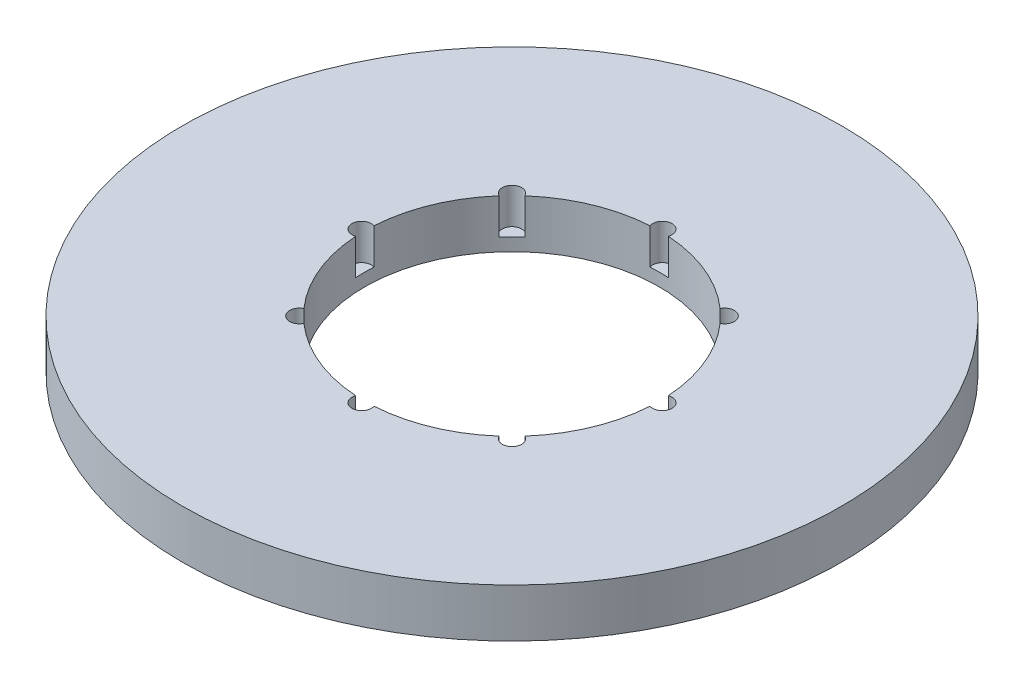
ISO-10303-21;
HEADER;
FILE_DESCRIPTION(('STEP AP214'),'2;1');
FILE_NAME('part.step','',(''),(''),'','','');
FILE_SCHEMA(('AUTOMOTIVE_DESIGN { 1 0 10303 214 1 1 1 1 }'));
ENDSEC;
DATA;
#1=APPLICATION_CONTEXT('core data for automotive mechanical design processes');
#2=APPLICATION_PROTOCOL_DEFINITION('international standard','automotive_design',2000,#1);
#3=PRODUCT_CONTEXT('',#1,'mechanical');
#4=PRODUCT('Part','Part','',(#3));
#5=PRODUCT_RELATED_PRODUCT_CATEGORY('part','',(#4));
#6=PRODUCT_DEFINITION_FORMATION('','',#4);
#7=PRODUCT_DEFINITION_CONTEXT('part definition',#1,'design');
#8=PRODUCT_DEFINITION('design','',#6,#7);
#9=PRODUCT_DEFINITION_SHAPE('','',#8);
#10=(LENGTH_UNIT() NAMED_UNIT(*) SI_UNIT(.MILLI.,.METRE.));
#11=(NAMED_UNIT(*) PLANE_ANGLE_UNIT() SI_UNIT($,.RADIAN.));
#12=(NAMED_UNIT(*) SI_UNIT($,.STERADIAN.) SOLID_ANGLE_UNIT());
#13=UNCERTAINTY_MEASURE_WITH_UNIT(LENGTH_MEASURE(1.E-05),#10,'distance_accuracy_value','');
#14=(GEOMETRIC_REPRESENTATION_CONTEXT(3) GLOBAL_UNCERTAINTY_ASSIGNED_CONTEXT((#13)) GLOBAL_UNIT_ASSIGNED_CONTEXT((#10,
#11,#12)) REPRESENTATION_CONTEXT('',''));
#15=CARTESIAN_POINT('',(0.,0.,0.));
#16=DIRECTION('',(0.,0.,1.));
#17=DIRECTION('',(1.,0.,0.));
#18=AXIS2_PLACEMENT_3D('',#15,#16,#17);
#19=CARTESIAN_POINT('',(0.,14.,0.));
#20=DIRECTION('',(0.,-1.,0.));
#21=DIRECTION('',(0.,0.,-1.));
#22=AXIS2_PLACEMENT_3D('',#19,#20,#21);
#23=CYLINDRICAL_SURFACE('',#22,95.);
#24=CARTESIAN_POINT('',(0.,14.,0.));
#25=DIRECTION('',(0.,1.,0.));
#26=DIRECTION('',(0.,0.,1.));
#27=AXIS2_PLACEMENT_3D('',#24,#25,#26);
#28=CIRCLE('',#27,95.);
#29=CARTESIAN_POINT('',(0.,14.,95.));
#30=VERTEX_POINT('',#29);
#31=EDGE_CURVE('E195',#30,#30,#28,.T.);
#32=ORIENTED_EDGE('',*,*,#31,.F.);
#33=EDGE_LOOP('',(#32));
#34=FACE_BOUND('',#33,.T.);
#35=CARTESIAN_POINT('',(0.,0.,0.));
#36=DIRECTION('',(0.,1.,0.));
#37=DIRECTION('',(0.,0.,1.));
#38=AXIS2_PLACEMENT_3D('',#35,#36,#37);
#39=CIRCLE('',#38,95.);
#40=CARTESIAN_POINT('',(0.,0.,95.));
#41=VERTEX_POINT('',#40);
#42=EDGE_CURVE('E179',#41,#41,#39,.T.);
#43=ORIENTED_EDGE('',*,*,#42,.T.);
#44=EDGE_LOOP('',(#43));
#45=FACE_BOUND('',#44,.T.);
#46=ADVANCED_FACE('F39',(#34,#45),#23,.T.);
#47=CARTESIAN_POINT('',(0.,14.,0.));
#48=DIRECTION('',(0.,1.,0.));
#49=DIRECTION('',(0.,0.,1.));
#50=AXIS2_PLACEMENT_3D('',#47,#48,#49);
#51=PLANE('',#50);
#52=CARTESIAN_POINT('',(1.51345955603055E-13,14.,43.3472045000824));
#53=DIRECTION('',(0.,1.,0.));
#54=DIRECTION('',(1.,0.,0.));
#55=AXIS2_PLACEMENT_3D('',#52,#53,#54);
#56=CIRCLE('',#55,2.78412642007656);
#57=CARTESIAN_POINT('',(-2.62479582339543,14.,42.4188689958312));
#58=VERTEX_POINT('',#57);
#59=CARTESIAN_POINT('',(2.62479582339572,14.,42.4188689958312));
#60=VERTEX_POINT('',#59);
#61=EDGE_CURVE('E176',#58,#60,#56,.T.);
#62=ORIENTED_EDGE('',*,*,#61,.F.);
#63=CARTESIAN_POINT('',(0.,14.,0.));
#64=DIRECTION('',(0.,1.,0.));
#65=DIRECTION('',(0.,0.,1.));
#66=AXIS2_PLACEMENT_3D('',#63,#64,#65);
#67=CIRCLE('',#66,42.5);
#68=CARTESIAN_POINT('',(-28.1386589912628,14.,31.8506808431692));
#69=VERTEX_POINT('',#68);
#70=EDGE_CURVE('E166',#69,#58,#67,.T.);
#71=ORIENTED_EDGE('',*,*,#70,.F.);
#72=CARTESIAN_POINT('',(-30.6511022474883,14.,30.6511022474884));
#73=DIRECTION('',(0.,1.,0.));
#74=DIRECTION('',(0.707106781186549,0.,0.707106781186546));
#75=AXIS2_PLACEMENT_3D('',#72,#73,#74);
#76=CIRCLE('',#75,2.78412642007656);
#77=CARTESIAN_POINT('',(-31.8506808431691,14.,28.1386589912629));
#78=VERTEX_POINT('',#77);
#79=EDGE_CURVE('E147',#78,#69,#76,.T.);
#80=ORIENTED_EDGE('',*,*,#79,.F.);
#81=CARTESIAN_POINT('',(-42.4188689958312,14.,2.62479582339557));
#82=VERTEX_POINT('',#81);
#83=EDGE_CURVE('E180',#82,#78,#67,.T.);
#84=ORIENTED_EDGE('',*,*,#83,.F.);
#85=CARTESIAN_POINT('',(-43.3472045000824,14.,0.));
#86=DIRECTION('',(0.,1.,0.));
#87=DIRECTION('',(0.,0.,1.));
#88=AXIS2_PLACEMENT_3D('',#85,#86,#87);
#89=CIRCLE('',#88,2.78412642007656);
#90=CARTESIAN_POINT('',(-42.4188689958312,14.,-2.62479582339557));
#91=VERTEX_POINT('',#90);
#92=EDGE_CURVE('E186',#91,#82,#89,.T.);
#93=ORIENTED_EDGE('',*,*,#92,.F.);
#94=CARTESIAN_POINT('',(-31.8506808431695,14.,-28.1386589912625));
#95=VERTEX_POINT('',#94);
#96=EDGE_CURVE('E182',#95,#91,#67,.T.);
#97=ORIENTED_EDGE('',*,*,#96,.F.);
#98=CARTESIAN_POINT('',(-30.6511022474887,14.,-30.6511022474879));
#99=DIRECTION('',(0.,1.,0.));
#100=DIRECTION('',(-0.707106781186539,0.,0.707106781186556));
#101=AXIS2_PLACEMENT_3D('',#98,#99,#100);
#102=CIRCLE('',#101,2.78412642007656);
#103=CARTESIAN_POINT('',(-28.1386589912633,14.,-31.8506808431688));
#104=VERTEX_POINT('',#103);
#105=EDGE_CURVE('E446',#104,#95,#102,.T.);
#106=ORIENTED_EDGE('',*,*,#105,.F.);
#107=CARTESIAN_POINT('',(-2.62479582339602,14.,-42.4188689958311));
#108=VERTEX_POINT('',#107);
#109=EDGE_CURVE('E452',#108,#104,#67,.T.);
#110=ORIENTED_EDGE('',*,*,#109,.F.);
#111=CARTESIAN_POINT('',(-4.54037866809165E-13,14.,-43.3472045000824));
#112=DIRECTION('',(0.,1.,0.));
#113=DIRECTION('',(-1.,0.,0.));
#114=AXIS2_PLACEMENT_3D('',#111,#112,#113);
#115=CIRCLE('',#114,2.78412642007656);
#116=CARTESIAN_POINT('',(2.62479582339513,14.,-42.4188689958312));
#117=VERTEX_POINT('',#116);
#118=EDGE_CURVE('E477',#117,#108,#115,.T.);
#119=ORIENTED_EDGE('',*,*,#118,.F.);
#120=CARTESIAN_POINT('',(28.1386589912626,14.,-31.8506808431694));
#121=VERTEX_POINT('',#120);
#122=EDGE_CURVE('E460',#121,#117,#67,.T.);
#123=ORIENTED_EDGE('',*,*,#122,.F.);
#124=CARTESIAN_POINT('',(30.651102247488,14.,-30.6511022474886));
#125=DIRECTION('',(0.,1.,0.));
#126=DIRECTION('',(-0.707106781186554,0.,-0.707106781186541));
#127=AXIS2_PLACEMENT_3D('',#124,#125,#126);
#128=CIRCLE('',#127,2.78412642007656);
#129=CARTESIAN_POINT('',(31.8506808431689,14.,-28.1386589912631));
#130=VERTEX_POINT('',#129);
#131=EDGE_CURVE('E464',#130,#121,#128,.T.);
#132=ORIENTED_EDGE('',*,*,#131,.F.);
#133=CARTESIAN_POINT('',(42.4188689958312,14.,-2.62479582339557));
#134=VERTEX_POINT('',#133);
#135=EDGE_CURVE('E459',#134,#130,#67,.T.);
#136=ORIENTED_EDGE('',*,*,#135,.F.);
#137=CARTESIAN_POINT('',(43.3472045000824,14.,0.));
#138=DIRECTION('',(0.,1.,0.));
#139=DIRECTION('',(0.,0.,-1.));
#140=AXIS2_PLACEMENT_3D('',#137,#138,#139);
#141=CIRCLE('',#140,2.78412642007656);
#142=CARTESIAN_POINT('',(42.4188689958312,14.,2.62479582339557));
#143=VERTEX_POINT('',#142);
#144=EDGE_CURVE('E469',#143,#134,#141,.T.);
#145=ORIENTED_EDGE('',*,*,#144,.F.);
#146=CARTESIAN_POINT('',(31.8506808431693,14.,28.1386589912627));
#147=VERTEX_POINT('',#146);
#148=EDGE_CURVE('E181',#147,#143,#67,.T.);
#149=ORIENTED_EDGE('',*,*,#148,.F.);
#150=CARTESIAN_POINT('',(30.6511022474885,14.,30.6511022474882));
#151=DIRECTION('',(0.,1.,0.));
#152=DIRECTION('',(0.707106781186544,0.,-0.707106781186551));
#153=AXIS2_PLACEMENT_3D('',#150,#151,#152);
#154=CIRCLE('',#153,2.78412642007656);
#155=CARTESIAN_POINT('',(28.138658991263,14.,31.850680843169));
#156=VERTEX_POINT('',#155);
#157=EDGE_CURVE('E475',#156,#147,#154,.T.);
#158=ORIENTED_EDGE('',*,*,#157,.F.);
#159=EDGE_CURVE('E177',#60,#156,#67,.T.);
#160=ORIENTED_EDGE('',*,*,#159,.F.);
#161=EDGE_LOOP('',(#62,#71,#80,#84,#93,#97,#106,#110,#119,#123,#132,#136,#145,#149,#158,#160));
#162=FACE_BOUND('',#161,.T.);
#163=ORIENTED_EDGE('',*,*,#31,.T.);
#164=EDGE_LOOP('',(#163));
#165=FACE_BOUND('',#164,.T.);
#166=ADVANCED_FACE('F172',(#162,#165),#51,.T.);
#167=CARTESIAN_POINT('',(0.,0.,0.));
#168=DIRECTION('',(0.,1.,0.));
#169=DIRECTION('',(0.,0.,1.));
#170=AXIS2_PLACEMENT_3D('',#167,#168,#169);
#171=PLANE('',#170);
#172=CARTESIAN_POINT('',(0.,0.,0.));
#173=DIRECTION('',(0.,1.,0.));
#174=DIRECTION('',(0.,0.,1.));
#175=AXIS2_PLACEMENT_3D('',#172,#173,#174);
#176=CIRCLE('',#175,42.5);
#177=CARTESIAN_POINT('',(0.,0.,42.5));
#178=VERTEX_POINT('',#177);
#179=EDGE_CURVE('E187',#178,#178,#176,.T.);
#180=ORIENTED_EDGE('',*,*,#179,.T.);
#181=EDGE_LOOP('',(#180));
#182=FACE_BOUND('',#181,.T.);
#183=ORIENTED_EDGE('',*,*,#42,.F.);
#184=EDGE_LOOP('',(#183));
#185=FACE_BOUND('',#184,.T.);
#186=ADVANCED_FACE('F270',(#182,#185),#171,.F.);
#187=CARTESIAN_POINT('',(0.,14.,0.));
#188=DIRECTION('',(0.,-1.,0.));
#189=DIRECTION('',(0.,0.,-1.));
#190=AXIS2_PLACEMENT_3D('',#187,#188,#189);
#191=CYLINDRICAL_SURFACE('',#190,42.5);
#192=DIRECTION('',(0.,1.,0.));
#193=VECTOR('',#192,1.);
#194=CARTESIAN_POINT('',(-2.62479582339543,8.83772118464505,42.4188689958312));
#195=LINE('',#194,#193);
#196=CARTESIAN_POINT('',(-2.62479582339543,3.67544236929009,42.4188689958312));
#197=VERTEX_POINT('',#196);
#198=EDGE_CURVE('E11',#197,#58,#195,.T.);
#199=ORIENTED_EDGE('',*,*,#198,.F.);
#200=CARTESIAN_POINT('',(0.,3.67544236929009,0.));
#201=DIRECTION('',(0.,1.,0.));
#202=DIRECTION('',(0.,0.,1.));
#203=AXIS2_PLACEMENT_3D('',#200,#201,#202);
#204=CIRCLE('',#203,42.5);
#205=CARTESIAN_POINT('',(2.62479582339572,3.67544236929009,42.4188689958312));
#206=VERTEX_POINT('',#205);
#207=EDGE_CURVE('E250',#197,#206,#204,.T.);
#208=ORIENTED_EDGE('',*,*,#207,.T.);
#209=DIRECTION('',(0.,1.,0.));
#210=VECTOR('',#209,1.);
#211=CARTESIAN_POINT('',(2.62479582339572,8.83772118464505,42.4188689958312));
#212=LINE('',#211,#210);
#213=EDGE_CURVE('E46',#60,#206,#212,.F.);
#214=ORIENTED_EDGE('',*,*,#213,.F.);
#215=ORIENTED_EDGE('',*,*,#159,.T.);
#216=DIRECTION('',(0.,1.,0.));
#217=VECTOR('',#216,1.);
#218=CARTESIAN_POINT('',(28.138658991263,8.83772118464505,31.850680843169));
#219=LINE('',#218,#217);
#220=CARTESIAN_POINT('',(28.138658991263,3.67544236929009,31.850680843169));
#221=VERTEX_POINT('',#220);
#222=EDGE_CURVE('E244',#221,#156,#219,.T.);
#223=ORIENTED_EDGE('',*,*,#222,.F.);
#224=CARTESIAN_POINT('',(0.,3.67544236929009,0.));
#225=DIRECTION('',(0.,1.,0.));
#226=DIRECTION('',(0.,0.,1.));
#227=AXIS2_PLACEMENT_3D('',#224,#225,#226);
#228=CIRCLE('',#227,42.5);
#229=CARTESIAN_POINT('',(31.8506808431693,3.67544236929009,28.1386589912627));
#230=VERTEX_POINT('',#229);
#231=EDGE_CURVE('E238',#221,#230,#228,.T.);
#232=ORIENTED_EDGE('',*,*,#231,.T.);
#233=DIRECTION('',(0.,1.,0.));
#234=VECTOR('',#233,1.);
#235=CARTESIAN_POINT('',(31.8506808431693,8.83772118464505,28.1386589912627));
#236=LINE('',#235,#234);
#237=EDGE_CURVE('E242',#147,#230,#236,.F.);
#238=ORIENTED_EDGE('',*,*,#237,.F.);
#239=ORIENTED_EDGE('',*,*,#148,.T.);
#240=DIRECTION('',(0.,1.,0.));
#241=VECTOR('',#240,1.);
#242=CARTESIAN_POINT('',(42.4188689958312,8.83772118464505,2.62479582339557));
#243=LINE('',#242,#241);
#244=CARTESIAN_POINT('',(42.4188689958312,3.67544236929009,2.62479582339557));
#245=VERTEX_POINT('',#244);
#246=EDGE_CURVE('E236',#245,#143,#243,.T.);
#247=ORIENTED_EDGE('',*,*,#246,.F.);
#248=CARTESIAN_POINT('',(0.,3.67544236929009,0.));
#249=DIRECTION('',(0.,1.,0.));
#250=DIRECTION('',(0.,0.,1.));
#251=AXIS2_PLACEMENT_3D('',#248,#249,#250);
#252=CIRCLE('',#251,42.5);
#253=CARTESIAN_POINT('',(42.4188689958312,3.67544236929009,-2.62479582339557));
#254=VERTEX_POINT('',#253);
#255=EDGE_CURVE('E235',#245,#254,#252,.T.);
#256=ORIENTED_EDGE('',*,*,#255,.T.);
#257=DIRECTION('',(0.,1.,0.));
#258=VECTOR('',#257,1.);
#259=CARTESIAN_POINT('',(42.4188689958312,8.83772118464505,-2.62479582339557));
#260=LINE('',#259,#258);
#261=EDGE_CURVE('E234',#134,#254,#260,.F.);
#262=ORIENTED_EDGE('',*,*,#261,.F.);
#263=ORIENTED_EDGE('',*,*,#135,.T.);
#264=DIRECTION('',(0.,1.,0.));
#265=VECTOR('',#264,1.);
#266=CARTESIAN_POINT('',(31.8506808431689,8.83772118464505,-28.1386589912631));
#267=LINE('',#266,#265);
#268=CARTESIAN_POINT('',(31.8506808431689,3.67544236929009,-28.1386589912631));
#269=VERTEX_POINT('',#268);
#270=EDGE_CURVE('E229',#269,#130,#267,.T.);
#271=ORIENTED_EDGE('',*,*,#270,.F.);
#272=CARTESIAN_POINT('',(0.,3.67544236929009,0.));
#273=DIRECTION('',(0.,1.,0.));
#274=DIRECTION('',(0.,0.,1.));
#275=AXIS2_PLACEMENT_3D('',#272,#273,#274);
#276=CIRCLE('',#275,42.5);
#277=CARTESIAN_POINT('',(28.1386589912626,3.67544236929009,-31.8506808431694));
#278=VERTEX_POINT('',#277);
#279=EDGE_CURVE('E221',#269,#278,#276,.T.);
#280=ORIENTED_EDGE('',*,*,#279,.T.);
#281=DIRECTION('',(0.,1.,0.));
#282=VECTOR('',#281,1.);
#283=CARTESIAN_POINT('',(28.1386589912626,8.83772118464505,-31.8506808431694));
#284=LINE('',#283,#282);
#285=EDGE_CURVE('E230',#121,#278,#284,.F.);
#286=ORIENTED_EDGE('',*,*,#285,.F.);
#287=ORIENTED_EDGE('',*,*,#122,.T.);
#288=DIRECTION('',(0.,1.,0.));
#289=VECTOR('',#288,1.);
#290=CARTESIAN_POINT('',(2.62479582339513,8.83772118464505,-42.4188689958312));
#291=LINE('',#290,#289);
#292=CARTESIAN_POINT('',(2.62479582339513,3.67544236929009,-42.4188689958312));
#293=VERTEX_POINT('',#292);
#294=EDGE_CURVE('E225',#293,#117,#291,.T.);
#295=ORIENTED_EDGE('',*,*,#294,.F.);
#296=CARTESIAN_POINT('',(0.,3.67544236929009,0.));
#297=DIRECTION('',(0.,1.,0.));
#298=DIRECTION('',(0.,0.,1.));
#299=AXIS2_PLACEMENT_3D('',#296,#297,#298);
#300=CIRCLE('',#299,42.5);
#301=CARTESIAN_POINT('',(-2.62479582339602,3.67544236929009,-42.4188689958311));
#302=VERTEX_POINT('',#301);
#303=EDGE_CURVE('E216',#293,#302,#300,.T.);
#304=ORIENTED_EDGE('',*,*,#303,.T.);
#305=DIRECTION('',(0.,1.,0.));
#306=VECTOR('',#305,1.);
#307=CARTESIAN_POINT('',(-2.62479582339602,8.83772118464505,-42.4188689958311));
#308=LINE('',#307,#306);
#309=EDGE_CURVE('E218',#108,#302,#308,.F.);
#310=ORIENTED_EDGE('',*,*,#309,.F.);
#311=ORIENTED_EDGE('',*,*,#109,.T.);
#312=DIRECTION('',(0.,1.,0.));
#313=VECTOR('',#312,1.);
#314=CARTESIAN_POINT('',(-28.1386589912633,8.83772118464505,-31.8506808431688));
#315=LINE('',#314,#313);
#316=CARTESIAN_POINT('',(-28.1386589912633,3.67544236929009,-31.8506808431688));
#317=VERTEX_POINT('',#316);
#318=EDGE_CURVE('E212',#317,#104,#315,.T.);
#319=ORIENTED_EDGE('',*,*,#318,.F.);
#320=CARTESIAN_POINT('',(0.,3.67544236929009,0.));
#321=DIRECTION('',(0.,1.,0.));
#322=DIRECTION('',(0.,0.,1.));
#323=AXIS2_PLACEMENT_3D('',#320,#321,#322);
#324=CIRCLE('',#323,42.5);
#325=CARTESIAN_POINT('',(-31.8506808431695,3.67544236929009,-28.1386589912625));
#326=VERTEX_POINT('',#325);
#327=EDGE_CURVE('E208',#317,#326,#324,.T.);
#328=ORIENTED_EDGE('',*,*,#327,.T.);
#329=DIRECTION('',(0.,1.,0.));
#330=VECTOR('',#329,1.);
#331=CARTESIAN_POINT('',(-31.8506808431695,8.83772118464505,-28.1386589912625));
#332=LINE('',#331,#330);
#333=EDGE_CURVE('E211',#95,#326,#332,.F.);
#334=ORIENTED_EDGE('',*,*,#333,.F.);
#335=ORIENTED_EDGE('',*,*,#96,.T.);
#336=DIRECTION('',(0.,1.,0.));
#337=VECTOR('',#336,1.);
#338=CARTESIAN_POINT('',(-42.4188689958312,8.83772118464505,-2.62479582339557));
#339=LINE('',#338,#337);
#340=CARTESIAN_POINT('',(-42.4188689958312,3.67544236929009,-2.62479582339557));
#341=VERTEX_POINT('',#340);
#342=EDGE_CURVE('E201',#341,#91,#339,.T.);
#343=ORIENTED_EDGE('',*,*,#342,.F.);
#344=CARTESIAN_POINT('',(0.,3.67544236929009,0.));
#345=DIRECTION('',(0.,1.,0.));
#346=DIRECTION('',(0.,0.,1.));
#347=AXIS2_PLACEMENT_3D('',#344,#345,#346);
#348=CIRCLE('',#347,42.5);
#349=CARTESIAN_POINT('',(-42.4188689958312,3.67544236929009,2.62479582339557));
#350=VERTEX_POINT('',#349);
#351=EDGE_CURVE('E194',#341,#350,#348,.T.);
#352=ORIENTED_EDGE('',*,*,#351,.T.);
#353=DIRECTION('',(0.,1.,0.));
#354=VECTOR('',#353,1.);
#355=CARTESIAN_POINT('',(-42.4188689958312,8.83772118464505,2.62479582339557));
#356=LINE('',#355,#354);
#357=EDGE_CURVE('E199',#82,#350,#356,.F.);
#358=ORIENTED_EDGE('',*,*,#357,.F.);
#359=ORIENTED_EDGE('',*,*,#83,.T.);
#360=DIRECTION('',(0.,1.,0.));
#361=VECTOR('',#360,1.);
#362=CARTESIAN_POINT('',(-31.8506808431691,8.83772118464505,28.1386589912629));
#363=LINE('',#362,#361);
#364=CARTESIAN_POINT('',(-31.8506808431691,3.67544236929009,28.1386589912629));
#365=VERTEX_POINT('',#364);
#366=EDGE_CURVE('E160',#365,#78,#363,.T.);
#367=ORIENTED_EDGE('',*,*,#366,.F.);
#368=CARTESIAN_POINT('',(0.,3.67544236929009,0.));
#369=DIRECTION('',(0.,1.,0.));
#370=DIRECTION('',(0.,0.,1.));
#371=AXIS2_PLACEMENT_3D('',#368,#369,#370);
#372=CIRCLE('',#371,42.5);
#373=CARTESIAN_POINT('',(-28.1386589912628,3.67544236929009,31.8506808431692));
#374=VERTEX_POINT('',#373);
#375=EDGE_CURVE('E168',#365,#374,#372,.T.);
#376=ORIENTED_EDGE('',*,*,#375,.T.);
#377=DIRECTION('',(0.,1.,0.));
#378=VECTOR('',#377,1.);
#379=CARTESIAN_POINT('',(-28.1386589912628,8.83772118464505,31.8506808431692));
#380=LINE('',#379,#378);
#381=EDGE_CURVE('E152',#69,#374,#380,.F.);
#382=ORIENTED_EDGE('',*,*,#381,.F.);
#383=ORIENTED_EDGE('',*,*,#70,.T.);
#384=EDGE_LOOP('',(#199,#208,#214,#215,#223,#232,#238,#239,#247,#256,#262,#263,#271,#280,#286,
#287,#295,#304,#310,#311,#319,#328,#334,#335,#343,#352,#358,#359,#367,#376,#382,#383));
#385=FACE_BOUND('',#384,.T.);
#386=ORIENTED_EDGE('',*,*,#179,.F.);
#387=EDGE_LOOP('',(#386));
#388=FACE_BOUND('',#387,.T.);
#389=ADVANCED_FACE('F170',(#385,#388),#191,.F.);
#390=CARTESIAN_POINT('',(-43.3472045000824,3.67544236929009,0.));
#391=DIRECTION('',(0.,1.,0.));
#392=DIRECTION('',(0.,0.,1.));
#393=AXIS2_PLACEMENT_3D('',#390,#391,#392);
#394=CYLINDRICAL_SURFACE('',#393,2.78412642007656);
#395=ORIENTED_EDGE('',*,*,#342,.T.);
#396=ORIENTED_EDGE('',*,*,#92,.T.);
#397=ORIENTED_EDGE('',*,*,#357,.T.);
#398=CARTESIAN_POINT('',(-43.3472045000824,3.67544236929009,0.));
#399=DIRECTION('',(0.,1.,0.));
#400=DIRECTION('',(0.,0.,1.));
#401=AXIS2_PLACEMENT_3D('',#398,#399,#400);
#402=CIRCLE('',#401,2.78412642007656);
#403=EDGE_CURVE('E191',#341,#350,#402,.T.);
#404=ORIENTED_EDGE('',*,*,#403,.F.);
#405=EDGE_LOOP('',(#395,#396,#397,#404));
#406=FACE_BOUND('',#405,.T.);
#407=ADVANCED_FACE('F279',(#406),#394,.F.);
#408=CARTESIAN_POINT('',(-43.3472045000824,3.67544236929009,0.));
#409=DIRECTION('',(0.,1.,0.));
#410=DIRECTION('',(0.,0.,1.));
#411=AXIS2_PLACEMENT_3D('',#408,#409,#410);
#412=PLANE('',#411);
#413=ORIENTED_EDGE('',*,*,#403,.T.);
#414=ORIENTED_EDGE('',*,*,#351,.F.);
#415=EDGE_LOOP('',(#413,#414));
#416=FACE_BOUND('',#415,.T.);
#417=ADVANCED_FACE('F285',(#416),#412,.T.);
#418=CARTESIAN_POINT('',(-30.6511022474883,3.67544236929009,30.6511022474884));
#419=DIRECTION('',(0.,1.,0.));
#420=DIRECTION('',(0.,0.,1.));
#421=AXIS2_PLACEMENT_3D('',#418,#419,#420);
#422=CYLINDRICAL_SURFACE('',#421,2.78412642007656);
#423=ORIENTED_EDGE('',*,*,#366,.T.);
#424=ORIENTED_EDGE('',*,*,#79,.T.);
#425=ORIENTED_EDGE('',*,*,#381,.T.);
#426=CARTESIAN_POINT('',(-30.6511022474883,3.67544236929009,30.6511022474884));
#427=DIRECTION('',(0.,1.,0.));
#428=DIRECTION('',(0.707106781186549,0.,0.707106781186546));
#429=AXIS2_PLACEMENT_3D('',#426,#427,#428);
#430=CIRCLE('',#429,2.78412642007656);
#431=EDGE_CURVE('E165',#365,#374,#430,.T.);
#432=ORIENTED_EDGE('',*,*,#431,.F.);
#433=EDGE_LOOP('',(#423,#424,#425,#432));
#434=FACE_BOUND('',#433,.T.);
#435=ADVANCED_FACE('F155',(#434),#422,.F.);
#436=CARTESIAN_POINT('',(-30.6511022474883,3.67544236929009,30.6511022474884));
#437=DIRECTION('',(0.,1.,0.));
#438=DIRECTION('',(0.707106781186549,0.,0.707106781186546));
#439=AXIS2_PLACEMENT_3D('',#436,#437,#438);
#440=PLANE('',#439);
#441=ORIENTED_EDGE('',*,*,#431,.T.);
#442=ORIENTED_EDGE('',*,*,#375,.F.);
#443=EDGE_LOOP('',(#441,#442));
#444=FACE_BOUND('',#443,.T.);
#445=ADVANCED_FACE('F288',(#444),#440,.T.);
#446=CARTESIAN_POINT('',(-30.6511022474887,3.67544236929009,-30.6511022474879));
#447=DIRECTION('',(0.,1.,0.));
#448=DIRECTION('',(0.,0.,1.));
#449=AXIS2_PLACEMENT_3D('',#446,#447,#448);
#450=CYLINDRICAL_SURFACE('',#449,2.78412642007656);
#451=ORIENTED_EDGE('',*,*,#318,.T.);
#452=ORIENTED_EDGE('',*,*,#105,.T.);
#453=ORIENTED_EDGE('',*,*,#333,.T.);
#454=CARTESIAN_POINT('',(-30.6511022474887,3.67544236929009,-30.6511022474879));
#455=DIRECTION('',(0.,1.,0.));
#456=DIRECTION('',(-0.707106781186539,0.,0.707106781186556));
#457=AXIS2_PLACEMENT_3D('',#454,#455,#456);
#458=CIRCLE('',#457,2.78412642007656);
#459=EDGE_CURVE('E447',#317,#326,#458,.T.);
#460=ORIENTED_EDGE('',*,*,#459,.F.);
#461=EDGE_LOOP('',(#451,#452,#453,#460));
#462=FACE_BOUND('',#461,.T.);
#463=ADVANCED_FACE('F295',(#462),#450,.F.);
#464=CARTESIAN_POINT('',(-30.6511022474887,3.67544236929009,-30.6511022474879));
#465=DIRECTION('',(0.,1.,0.));
#466=DIRECTION('',(-0.707106781186539,0.,0.707106781186556));
#467=AXIS2_PLACEMENT_3D('',#464,#465,#466);
#468=PLANE('',#467);
#469=ORIENTED_EDGE('',*,*,#459,.T.);
#470=ORIENTED_EDGE('',*,*,#327,.F.);
#471=EDGE_LOOP('',(#469,#470));
#472=FACE_BOUND('',#471,.T.);
#473=ADVANCED_FACE('F375',(#472),#468,.T.);
#474=CARTESIAN_POINT('',(-4.54037866809165E-13,3.67544236929009,-43.3472045000824));
#475=DIRECTION('',(0.,1.,0.));
#476=DIRECTION('',(0.,0.,1.));
#477=AXIS2_PLACEMENT_3D('',#474,#475,#476);
#478=CYLINDRICAL_SURFACE('',#477,2.78412642007656);
#479=ORIENTED_EDGE('',*,*,#294,.T.);
#480=ORIENTED_EDGE('',*,*,#118,.T.);
#481=ORIENTED_EDGE('',*,*,#309,.T.);
#482=CARTESIAN_POINT('',(-4.54037866809165E-13,3.67544236929009,-43.3472045000824));
#483=DIRECTION('',(0.,1.,0.));
#484=DIRECTION('',(-1.,0.,0.));
#485=AXIS2_PLACEMENT_3D('',#482,#483,#484);
#486=CIRCLE('',#485,2.78412642007656);
#487=EDGE_CURVE('E467',#293,#302,#486,.T.);
#488=ORIENTED_EDGE('',*,*,#487,.F.);
#489=EDGE_LOOP('',(#479,#480,#481,#488));
#490=FACE_BOUND('',#489,.T.);
#491=ADVANCED_FACE('F361',(#490),#478,.F.);
#492=CARTESIAN_POINT('',(-4.54037866809165E-13,3.67544236929009,-43.3472045000824));
#493=DIRECTION('',(0.,1.,0.));
#494=DIRECTION('',(-1.,0.,0.));
#495=AXIS2_PLACEMENT_3D('',#492,#493,#494);
#496=PLANE('',#495);
#497=ORIENTED_EDGE('',*,*,#487,.T.);
#498=ORIENTED_EDGE('',*,*,#303,.F.);
#499=EDGE_LOOP('',(#497,#498));
#500=FACE_BOUND('',#499,.T.);
#501=ADVANCED_FACE('F297',(#500),#496,.T.);
#502=CARTESIAN_POINT('',(30.651102247488,3.67544236929009,-30.6511022474886));
#503=DIRECTION('',(0.,1.,0.));
#504=DIRECTION('',(0.,0.,1.));
#505=AXIS2_PLACEMENT_3D('',#502,#503,#504);
#506=CYLINDRICAL_SURFACE('',#505,2.78412642007656);
#507=ORIENTED_EDGE('',*,*,#270,.T.);
#508=ORIENTED_EDGE('',*,*,#131,.T.);
#509=ORIENTED_EDGE('',*,*,#285,.T.);
#510=CARTESIAN_POINT('',(30.651102247488,3.67544236929009,-30.6511022474886));
#511=DIRECTION('',(0.,1.,0.));
#512=DIRECTION('',(-0.707106781186554,0.,-0.707106781186541));
#513=AXIS2_PLACEMENT_3D('',#510,#511,#512);
#514=CIRCLE('',#513,2.78412642007656);
#515=EDGE_CURVE('E470',#269,#278,#514,.T.);
#516=ORIENTED_EDGE('',*,*,#515,.F.);
#517=EDGE_LOOP('',(#507,#508,#509,#516));
#518=FACE_BOUND('',#517,.T.);
#519=ADVANCED_FACE('F294',(#518),#506,.F.);
#520=CARTESIAN_POINT('',(30.651102247488,3.67544236929009,-30.6511022474886));
#521=DIRECTION('',(0.,1.,0.));
#522=DIRECTION('',(-0.707106781186554,0.,-0.707106781186541));
#523=AXIS2_PLACEMENT_3D('',#520,#521,#522);
#524=PLANE('',#523);
#525=ORIENTED_EDGE('',*,*,#515,.T.);
#526=ORIENTED_EDGE('',*,*,#279,.F.);
#527=EDGE_LOOP('',(#525,#526));
#528=FACE_BOUND('',#527,.T.);
#529=ADVANCED_FACE('F300',(#528),#524,.T.);
#530=CARTESIAN_POINT('',(43.3472045000824,3.67544236929009,0.));
#531=DIRECTION('',(0.,1.,0.));
#532=DIRECTION('',(0.,0.,1.));
#533=AXIS2_PLACEMENT_3D('',#530,#531,#532);
#534=CYLINDRICAL_SURFACE('',#533,2.78412642007656);
#535=ORIENTED_EDGE('',*,*,#246,.T.);
#536=ORIENTED_EDGE('',*,*,#144,.T.);
#537=ORIENTED_EDGE('',*,*,#261,.T.);
#538=CARTESIAN_POINT('',(43.3472045000824,3.67544236929009,0.));
#539=DIRECTION('',(0.,1.,0.));
#540=DIRECTION('',(0.,0.,-1.));
#541=AXIS2_PLACEMENT_3D('',#538,#539,#540);
#542=CIRCLE('',#541,2.78412642007656);
#543=EDGE_CURVE('E472',#245,#254,#542,.T.);
#544=ORIENTED_EDGE('',*,*,#543,.F.);
#545=EDGE_LOOP('',(#535,#536,#537,#544));
#546=FACE_BOUND('',#545,.T.);
#547=ADVANCED_FACE('F305',(#546),#534,.F.);
#548=CARTESIAN_POINT('',(43.3472045000824,3.67544236929009,0.));
#549=DIRECTION('',(0.,1.,0.));
#550=DIRECTION('',(0.,0.,-1.));
#551=AXIS2_PLACEMENT_3D('',#548,#549,#550);
#552=PLANE('',#551);
#553=ORIENTED_EDGE('',*,*,#543,.T.);
#554=ORIENTED_EDGE('',*,*,#255,.F.);
#555=EDGE_LOOP('',(#553,#554));
#556=FACE_BOUND('',#555,.T.);
#557=ADVANCED_FACE('F308',(#556),#552,.T.);
#558=CARTESIAN_POINT('',(30.6511022474885,3.67544236929009,30.6511022474882));
#559=DIRECTION('',(0.,1.,0.));
#560=DIRECTION('',(0.,0.,1.));
#561=AXIS2_PLACEMENT_3D('',#558,#559,#560);
#562=CYLINDRICAL_SURFACE('',#561,2.78412642007656);
#563=ORIENTED_EDGE('',*,*,#222,.T.);
#564=ORIENTED_EDGE('',*,*,#157,.T.);
#565=ORIENTED_EDGE('',*,*,#237,.T.);
#566=CARTESIAN_POINT('',(30.6511022474885,3.67544236929009,30.6511022474882));
#567=DIRECTION('',(0.,1.,0.));
#568=DIRECTION('',(0.707106781186544,0.,-0.707106781186551));
#569=AXIS2_PLACEMENT_3D('',#566,#567,#568);
#570=CIRCLE('',#569,2.78412642007656);
#571=EDGE_CURVE('E56',#221,#230,#570,.T.);
#572=ORIENTED_EDGE('',*,*,#571,.F.);
#573=EDGE_LOOP('',(#563,#564,#565,#572));
#574=FACE_BOUND('',#573,.T.);
#575=ADVANCED_FACE('F309',(#574),#562,.F.);
#576=CARTESIAN_POINT('',(30.6511022474885,3.67544236929009,30.6511022474882));
#577=DIRECTION('',(0.,1.,0.));
#578=DIRECTION('',(0.707106781186544,0.,-0.707106781186551));
#579=AXIS2_PLACEMENT_3D('',#576,#577,#578);
#580=PLANE('',#579);
#581=ORIENTED_EDGE('',*,*,#571,.T.);
#582=ORIENTED_EDGE('',*,*,#231,.F.);
#583=EDGE_LOOP('',(#581,#582));
#584=FACE_BOUND('',#583,.T.);
#585=ADVANCED_FACE('F256',(#584),#580,.T.);
#586=CARTESIAN_POINT('',(1.51345955603055E-13,3.67544236929009,43.3472045000824));
#587=DIRECTION('',(0.,1.,0.));
#588=DIRECTION('',(0.,0.,1.));
#589=AXIS2_PLACEMENT_3D('',#586,#587,#588);
#590=CYLINDRICAL_SURFACE('',#589,2.78412642007656);
#591=ORIENTED_EDGE('',*,*,#198,.T.);
#592=ORIENTED_EDGE('',*,*,#61,.T.);
#593=ORIENTED_EDGE('',*,*,#213,.T.);
#594=CARTESIAN_POINT('',(1.51345955603055E-13,3.67544236929009,43.3472045000824));
#595=DIRECTION('',(0.,1.,0.));
#596=DIRECTION('',(1.,0.,0.));
#597=AXIS2_PLACEMENT_3D('',#594,#595,#596);
#598=CIRCLE('',#597,2.78412642007656);
#599=EDGE_CURVE('E55',#197,#206,#598,.T.);
#600=ORIENTED_EDGE('',*,*,#599,.F.);
#601=EDGE_LOOP('',(#591,#592,#593,#600));
#602=FACE_BOUND('',#601,.T.);
#603=ADVANCED_FACE('F253',(#602),#590,.F.);
#604=CARTESIAN_POINT('',(1.51345955603055E-13,3.67544236929009,43.3472045000824));
#605=DIRECTION('',(0.,1.,0.));
#606=DIRECTION('',(1.,0.,0.));
#607=AXIS2_PLACEMENT_3D('',#604,#605,#606);
#608=PLANE('',#607);
#609=ORIENTED_EDGE('',*,*,#599,.T.);
#610=ORIENTED_EDGE('',*,*,#207,.F.);
#611=EDGE_LOOP('',(#609,#610));
#612=FACE_BOUND('',#611,.T.);
#613=ADVANCED_FACE('F252',(#612),#608,.T.);
#614=CLOSED_SHELL('',(#46,#166,#186,#389,#407,#417,#435,#445,#463,#473,#491,#501,#519,#529,#547,
#557,#575,#585,#603,#613));
#615=MANIFOLD_SOLID_BREP('B2',#614);
#616=ADVANCED_BREP_SHAPE_REPRESENTATION('',(#18,#615),#14);
#617=SHAPE_DEFINITION_REPRESENTATION(#9,#616);
ENDSEC;
END-ISO-10303-21;
